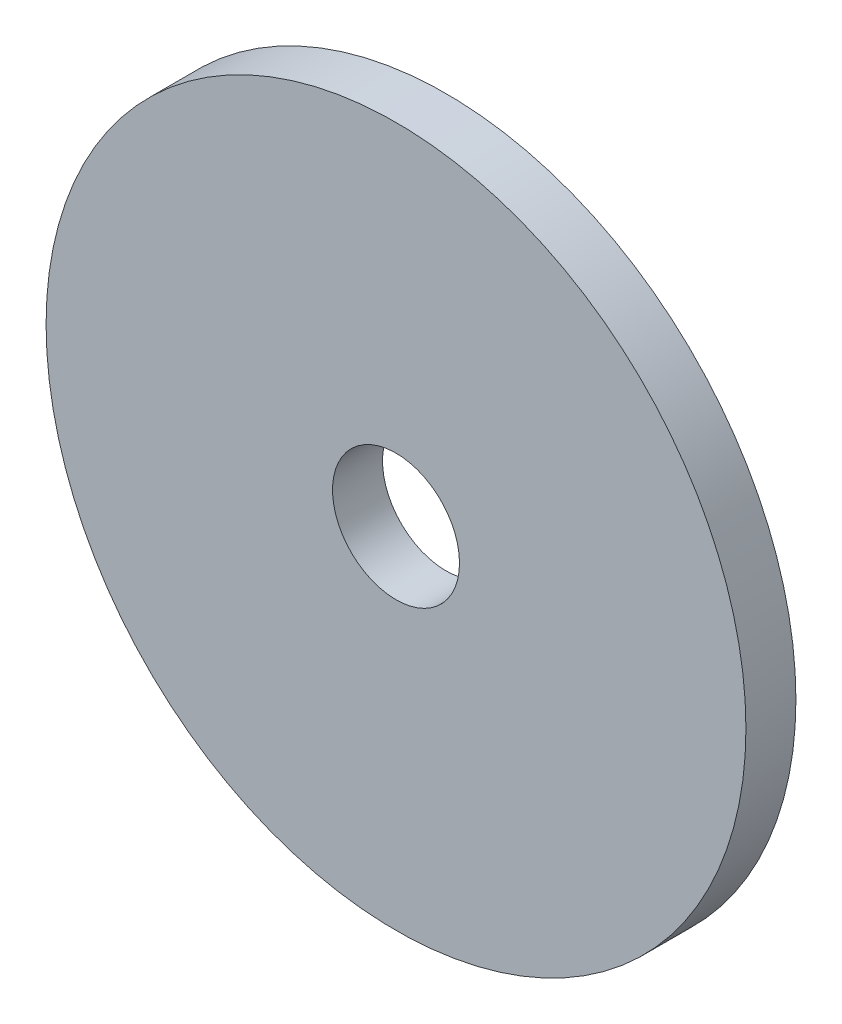
ISO-10303-21;
HEADER;
FILE_DESCRIPTION(('STEP AP214'),'2;1');
FILE_NAME('part.step','',(''),(''),'','','');
FILE_SCHEMA(('AUTOMOTIVE_DESIGN { 1 0 10303 214 1 1 1 1 }'));
ENDSEC;
DATA;
#1=APPLICATION_CONTEXT('core data for automotive mechanical design processes');
#2=APPLICATION_PROTOCOL_DEFINITION('international standard','automotive_design',2000,#1);
#3=PRODUCT_CONTEXT('',#1,'mechanical');
#4=PRODUCT('Part','Part','',(#3));
#5=PRODUCT_RELATED_PRODUCT_CATEGORY('part','',(#4));
#6=PRODUCT_DEFINITION_FORMATION('','',#4);
#7=PRODUCT_DEFINITION_CONTEXT('part definition',#1,'design');
#8=PRODUCT_DEFINITION('design','',#6,#7);
#9=PRODUCT_DEFINITION_SHAPE('','',#8);
#10=(LENGTH_UNIT() NAMED_UNIT(*) SI_UNIT(.MILLI.,.METRE.));
#11=(NAMED_UNIT(*) PLANE_ANGLE_UNIT() SI_UNIT($,.RADIAN.));
#12=(NAMED_UNIT(*) SI_UNIT($,.STERADIAN.) SOLID_ANGLE_UNIT());
#13=UNCERTAINTY_MEASURE_WITH_UNIT(LENGTH_MEASURE(1.E-05),#10,'distance_accuracy_value','');
#14=(GEOMETRIC_REPRESENTATION_CONTEXT(3) GLOBAL_UNCERTAINTY_ASSIGNED_CONTEXT((#13)) GLOBAL_UNIT_ASSIGNED_CONTEXT((#10,
#11,#12)) REPRESENTATION_CONTEXT('',''));
#15=CARTESIAN_POINT('',(0.,0.,0.));
#16=DIRECTION('',(0.,0.,1.));
#17=DIRECTION('',(1.,0.,0.));
#18=AXIS2_PLACEMENT_3D('',#15,#16,#17);
#19=CARTESIAN_POINT('',(0.,0.,20.));
#20=DIRECTION('',(0.,0.,1.));
#21=DIRECTION('',(1.,0.,0.));
#22=AXIS2_PLACEMENT_3D('',#19,#20,#21);
#23=PLANE('',#22);
#24=CARTESIAN_POINT('',(0.,0.,20.));
#25=DIRECTION('',(0.,0.,1.));
#26=DIRECTION('',(1.,0.,0.));
#27=AXIS2_PLACEMENT_3D('',#24,#25,#26);
#28=CIRCLE('',#27,140.);
#29=CARTESIAN_POINT('',(140.,0.,20.));
#30=VERTEX_POINT('',#29);
#31=EDGE_CURVE('E10',#30,#30,#28,.T.);
#32=ORIENTED_EDGE('',*,*,#31,.T.);
#33=EDGE_LOOP('',(#32));
#34=FACE_BOUND('',#33,.T.);
#35=CARTESIAN_POINT('',(0.,0.,20.));
#36=DIRECTION('',(0.,0.,1.));
#37=DIRECTION('',(1.,0.,0.));
#38=AXIS2_PLACEMENT_3D('',#35,#36,#37);
#39=CIRCLE('',#38,25.4);
#40=CARTESIAN_POINT('',(25.4,0.,20.));
#41=VERTEX_POINT('',#40);
#42=EDGE_CURVE('E50',#41,#41,#39,.T.);
#43=ORIENTED_EDGE('',*,*,#42,.F.);
#44=EDGE_LOOP('',(#43));
#45=FACE_BOUND('',#44,.T.);
#46=ADVANCED_FACE('F37',(#34,#45),#23,.T.);
#47=CARTESIAN_POINT('',(0.,0.,0.));
#48=DIRECTION('',(0.,0.,1.));
#49=DIRECTION('',(1.,0.,0.));
#50=AXIS2_PLACEMENT_3D('',#47,#48,#49);
#51=PLANE('',#50);
#52=CARTESIAN_POINT('',(0.,0.,0.));
#53=DIRECTION('',(0.,0.,1.));
#54=DIRECTION('',(1.,0.,0.));
#55=AXIS2_PLACEMENT_3D('',#52,#53,#54);
#56=CIRCLE('',#55,140.);
#57=CARTESIAN_POINT('',(140.,0.,0.));
#58=VERTEX_POINT('',#57);
#59=EDGE_CURVE('E41',#58,#58,#56,.T.);
#60=ORIENTED_EDGE('',*,*,#59,.F.);
#61=EDGE_LOOP('',(#60));
#62=FACE_BOUND('',#61,.T.);
#63=CARTESIAN_POINT('',(0.,0.,0.));
#64=DIRECTION('',(0.,0.,1.));
#65=DIRECTION('',(1.,0.,0.));
#66=AXIS2_PLACEMENT_3D('',#63,#64,#65);
#67=CIRCLE('',#66,25.4);
#68=CARTESIAN_POINT('',(25.4,0.,0.));
#69=VERTEX_POINT('',#68);
#70=EDGE_CURVE('E52',#69,#69,#67,.T.);
#71=ORIENTED_EDGE('',*,*,#70,.T.);
#72=EDGE_LOOP('',(#71));
#73=FACE_BOUND('',#72,.T.);
#74=ADVANCED_FACE('F64',(#62,#73),#51,.F.);
#75=CARTESIAN_POINT('',(0.,0.,20.));
#76=DIRECTION('',(0.,0.,-1.));
#77=DIRECTION('',(-1.,0.,0.));
#78=AXIS2_PLACEMENT_3D('',#75,#76,#77);
#79=CYLINDRICAL_SURFACE('',#78,140.);
#80=ORIENTED_EDGE('',*,*,#31,.F.);
#81=EDGE_LOOP('',(#80));
#82=FACE_BOUND('',#81,.T.);
#83=ORIENTED_EDGE('',*,*,#59,.T.);
#84=EDGE_LOOP('',(#83));
#85=FACE_BOUND('',#84,.T.);
#86=ADVANCED_FACE('F39',(#82,#85),#79,.T.);
#87=CARTESIAN_POINT('',(0.,0.,20.));
#88=DIRECTION('',(0.,0.,-1.));
#89=DIRECTION('',(-1.,0.,0.));
#90=AXIS2_PLACEMENT_3D('',#87,#88,#89);
#91=CYLINDRICAL_SURFACE('',#90,25.4);
#92=ORIENTED_EDGE('',*,*,#42,.T.);
#93=EDGE_LOOP('',(#92));
#94=FACE_BOUND('',#93,.T.);
#95=ORIENTED_EDGE('',*,*,#70,.F.);
#96=EDGE_LOOP('',(#95));
#97=FACE_BOUND('',#96,.T.);
#98=ADVANCED_FACE('F60',(#94,#97),#91,.F.);
#99=CLOSED_SHELL('',(#46,#74,#86,#98));
#100=MANIFOLD_SOLID_BREP('B2',#99);
#101=ADVANCED_BREP_SHAPE_REPRESENTATION('',(#18,#100),#14);
#102=SHAPE_DEFINITION_REPRESENTATION(#9,#101);
ENDSEC;
END-ISO-10303-21;
